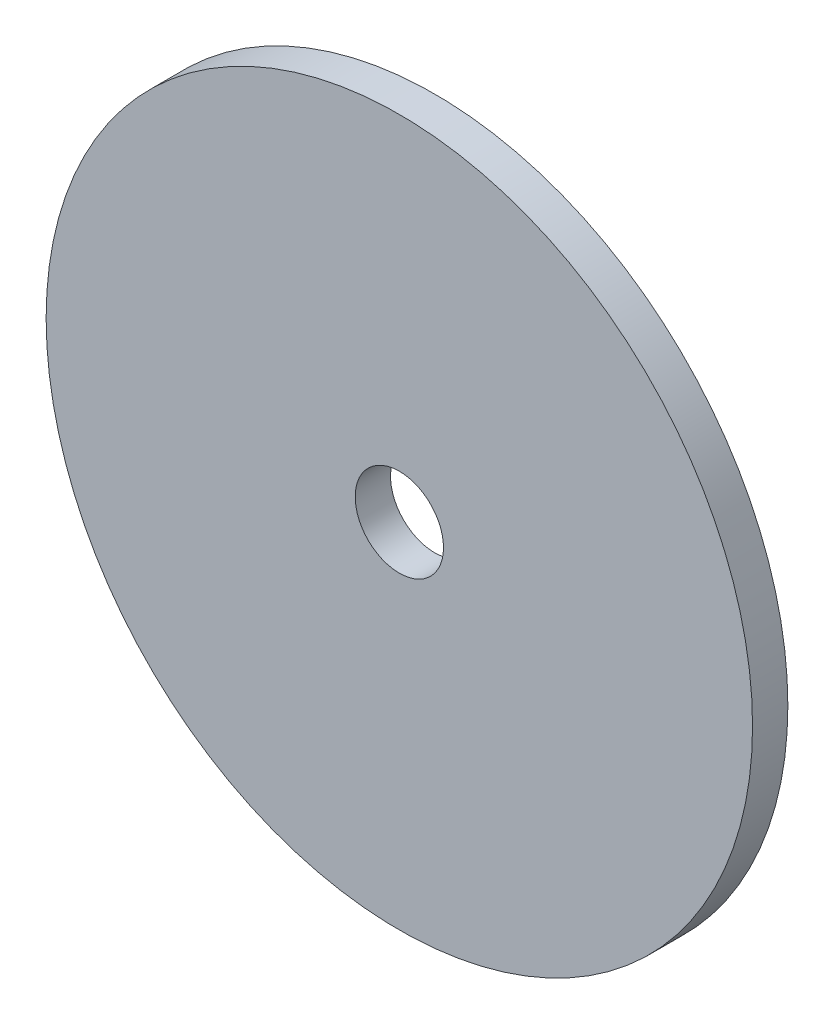
ISO-10303-21;
HEADER;
FILE_DESCRIPTION(('STEP AP214'),'2;1');
FILE_NAME('part.step','',(''),(''),'','','');
FILE_SCHEMA(('AUTOMOTIVE_DESIGN { 1 0 10303 214 1 1 1 1 }'));
ENDSEC;
DATA;
#1=APPLICATION_CONTEXT('core data for automotive mechanical design processes');
#2=APPLICATION_PROTOCOL_DEFINITION('international standard','automotive_design',2000,#1);
#3=PRODUCT_CONTEXT('',#1,'mechanical');
#4=PRODUCT('Part','Part','',(#3));
#5=PRODUCT_RELATED_PRODUCT_CATEGORY('part','',(#4));
#6=PRODUCT_DEFINITION_FORMATION('','',#4);
#7=PRODUCT_DEFINITION_CONTEXT('part definition',#1,'design');
#8=PRODUCT_DEFINITION('design','',#6,#7);
#9=PRODUCT_DEFINITION_SHAPE('','',#8);
#10=(LENGTH_UNIT() NAMED_UNIT(*) SI_UNIT(.MILLI.,.METRE.));
#11=(NAMED_UNIT(*) PLANE_ANGLE_UNIT() SI_UNIT($,.RADIAN.));
#12=(NAMED_UNIT(*) SI_UNIT($,.STERADIAN.) SOLID_ANGLE_UNIT());
#13=UNCERTAINTY_MEASURE_WITH_UNIT(LENGTH_MEASURE(1.E-05),#10,'distance_accuracy_value','');
#14=(GEOMETRIC_REPRESENTATION_CONTEXT(3) GLOBAL_UNCERTAINTY_ASSIGNED_CONTEXT((#13)) GLOBAL_UNIT_ASSIGNED_CONTEXT((#10,
#11,#12)) REPRESENTATION_CONTEXT('',''));
#15=CARTESIAN_POINT('',(0.,0.,0.));
#16=DIRECTION('',(0.,0.,1.));
#17=DIRECTION('',(1.,0.,0.));
#18=AXIS2_PLACEMENT_3D('',#15,#16,#17);
#19=CARTESIAN_POINT('',(0.,0.,2.54));
#20=DIRECTION('',(0.,0.,1.));
#21=DIRECTION('',(1.,0.,0.));
#22=AXIS2_PLACEMENT_3D('',#19,#20,#21);
#23=PLANE('',#22);
#24=CARTESIAN_POINT('',(0.,0.,2.54));
#25=DIRECTION('',(0.,0.,1.));
#26=DIRECTION('',(1.,0.,0.));
#27=AXIS2_PLACEMENT_3D('',#24,#25,#26);
#28=CIRCLE('',#27,25.4);
#29=CARTESIAN_POINT('',(25.4,0.,2.54));
#30=VERTEX_POINT('',#29);
#31=EDGE_CURVE('E10',#30,#30,#28,.T.);
#32=ORIENTED_EDGE('',*,*,#31,.T.);
#33=EDGE_LOOP('',(#32));
#34=FACE_BOUND('',#33,.T.);
#35=CARTESIAN_POINT('',(0.,0.,2.54));
#36=DIRECTION('',(0.,0.,1.));
#37=DIRECTION('',(1.,0.,0.));
#38=AXIS2_PLACEMENT_3D('',#35,#36,#37);
#39=CIRCLE('',#38,3.175);
#40=CARTESIAN_POINT('',(3.175,0.,2.54));
#41=VERTEX_POINT('',#40);
#42=EDGE_CURVE('E48',#41,#41,#39,.T.);
#43=ORIENTED_EDGE('',*,*,#42,.F.);
#44=EDGE_LOOP('',(#43));
#45=FACE_BOUND('',#44,.T.);
#46=ADVANCED_FACE('F37',(#34,#45),#23,.T.);
#47=CARTESIAN_POINT('',(0.,0.,0.));
#48=DIRECTION('',(0.,0.,1.));
#49=DIRECTION('',(1.,0.,0.));
#50=AXIS2_PLACEMENT_3D('',#47,#48,#49);
#51=PLANE('',#50);
#52=CARTESIAN_POINT('',(0.,0.,0.));
#53=DIRECTION('',(0.,0.,1.));
#54=DIRECTION('',(1.,0.,0.));
#55=AXIS2_PLACEMENT_3D('',#52,#53,#54);
#56=CIRCLE('',#55,25.4);
#57=CARTESIAN_POINT('',(25.4,0.,0.));
#58=VERTEX_POINT('',#57);
#59=EDGE_CURVE('E41',#58,#58,#56,.T.);
#60=ORIENTED_EDGE('',*,*,#59,.F.);
#61=EDGE_LOOP('',(#60));
#62=FACE_BOUND('',#61,.T.);
#63=CARTESIAN_POINT('',(0.,0.,0.));
#64=DIRECTION('',(0.,0.,1.));
#65=DIRECTION('',(1.,0.,0.));
#66=AXIS2_PLACEMENT_3D('',#63,#64,#65);
#67=CIRCLE('',#66,3.175);
#68=CARTESIAN_POINT('',(3.175,0.,0.));
#69=VERTEX_POINT('',#68);
#70=EDGE_CURVE('E50',#69,#69,#67,.T.);
#71=ORIENTED_EDGE('',*,*,#70,.T.);
#72=EDGE_LOOP('',(#71));
#73=FACE_BOUND('',#72,.T.);
#74=ADVANCED_FACE('F60',(#62,#73),#51,.F.);
#75=CARTESIAN_POINT('',(0.,0.,2.54));
#76=DIRECTION('',(0.,0.,-1.));
#77=DIRECTION('',(-1.,0.,0.));
#78=AXIS2_PLACEMENT_3D('',#75,#76,#77);
#79=CYLINDRICAL_SURFACE('',#78,25.4);
#80=ORIENTED_EDGE('',*,*,#31,.F.);
#81=EDGE_LOOP('',(#80));
#82=FACE_BOUND('',#81,.T.);
#83=ORIENTED_EDGE('',*,*,#59,.T.);
#84=EDGE_LOOP('',(#83));
#85=FACE_BOUND('',#84,.T.);
#86=ADVANCED_FACE('F39',(#82,#85),#79,.T.);
#87=CARTESIAN_POINT('',(0.,0.,2.54));
#88=DIRECTION('',(0.,0.,-1.));
#89=DIRECTION('',(-1.,0.,0.));
#90=AXIS2_PLACEMENT_3D('',#87,#88,#89);
#91=CYLINDRICAL_SURFACE('',#90,3.175);
#92=ORIENTED_EDGE('',*,*,#42,.T.);
#93=EDGE_LOOP('',(#92));
#94=FACE_BOUND('',#93,.T.);
#95=ORIENTED_EDGE('',*,*,#70,.F.);
#96=EDGE_LOOP('',(#95));
#97=FACE_BOUND('',#96,.T.);
#98=ADVANCED_FACE('F56',(#94,#97),#91,.F.);
#99=CLOSED_SHELL('',(#46,#74,#86,#98));
#100=MANIFOLD_SOLID_BREP('B2',#99);
#101=ADVANCED_BREP_SHAPE_REPRESENTATION('',(#18,#100),#14);
#102=SHAPE_DEFINITION_REPRESENTATION(#9,#101);
ENDSEC;
END-ISO-10303-21;
